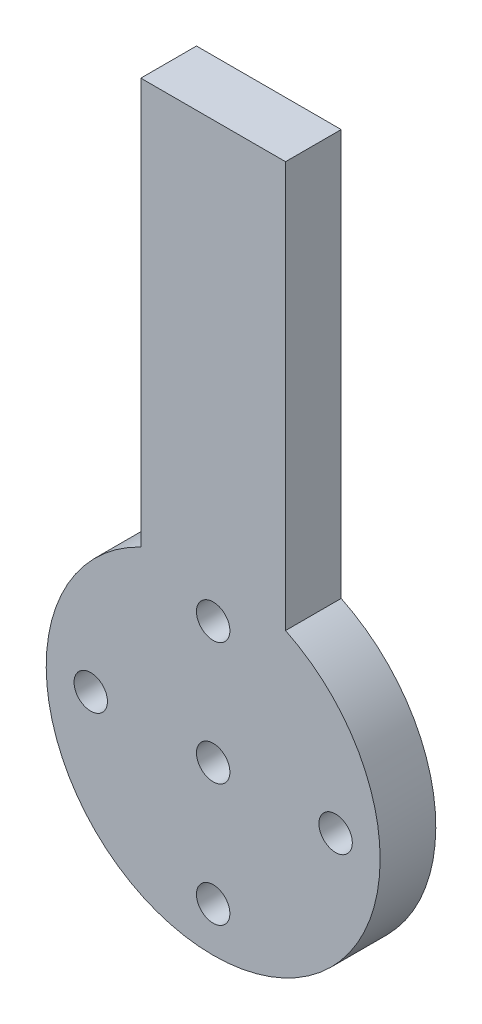
ISO-10303-21;
HEADER;
FILE_DESCRIPTION(('STEP AP214'),'2;1');
FILE_NAME('part.step','',(''),(''),'','','');
FILE_SCHEMA(('AUTOMOTIVE_DESIGN { 1 0 10303 214 1 1 1 1 }'));
ENDSEC;
DATA;
#1=APPLICATION_CONTEXT('core data for automotive mechanical design processes');
#2=APPLICATION_PROTOCOL_DEFINITION('international standard','automotive_design',2000,#1);
#3=PRODUCT_CONTEXT('',#1,'mechanical');
#4=PRODUCT('Part','Part','',(#3));
#5=PRODUCT_RELATED_PRODUCT_CATEGORY('part','',(#4));
#6=PRODUCT_DEFINITION_FORMATION('','',#4);
#7=PRODUCT_DEFINITION_CONTEXT('part definition',#1,'design');
#8=PRODUCT_DEFINITION('design','',#6,#7);
#9=PRODUCT_DEFINITION_SHAPE('','',#8);
#10=(LENGTH_UNIT() NAMED_UNIT(*) SI_UNIT(.MILLI.,.METRE.));
#11=(NAMED_UNIT(*) PLANE_ANGLE_UNIT() SI_UNIT($,.RADIAN.));
#12=(NAMED_UNIT(*) SI_UNIT($,.STERADIAN.) SOLID_ANGLE_UNIT());
#13=UNCERTAINTY_MEASURE_WITH_UNIT(LENGTH_MEASURE(1.E-05),#10,'distance_accuracy_value','');
#14=(GEOMETRIC_REPRESENTATION_CONTEXT(3) GLOBAL_UNCERTAINTY_ASSIGNED_CONTEXT((#13)) GLOBAL_UNIT_ASSIGNED_CONTEXT((#10,
#11,#12)) REPRESENTATION_CONTEXT('',''));
#15=CARTESIAN_POINT('',(0.,0.,0.));
#16=DIRECTION('',(0.,0.,1.));
#17=DIRECTION('',(1.,0.,0.));
#18=AXIS2_PLACEMENT_3D('',#15,#16,#17);
#19=CARTESIAN_POINT('',(2475.30786014581,4692.94783568175,5.));
#20=DIRECTION('',(0.,0.,1.));
#21=DIRECTION('',(1.,0.,0.));
#22=AXIS2_PLACEMENT_3D('',#19,#20,#21);
#23=PLANE('',#22);
#24=CARTESIAN_POINT('',(2475.30786014581,4703.94783568175,5.));
#25=DIRECTION('',(0.,0.,1.));
#26=DIRECTION('',(1.,0.,0.));
#27=AXIS2_PLACEMENT_3D('',#24,#25,#26);
#28=CIRCLE('',#27,1.50000000000006);
#29=CARTESIAN_POINT('',(2476.80786014581,4703.94783568175,5.));
#30=VERTEX_POINT('',#29);
#31=EDGE_CURVE('E129',#30,#30,#28,.T.);
#32=ORIENTED_EDGE('',*,*,#31,.F.);
#33=EDGE_LOOP('',(#32));
#34=FACE_BOUND('',#33,.T.);
#35=CARTESIAN_POINT('',(2464.30786014581,4692.94783568175,5.));
#36=DIRECTION('',(0.,0.,1.));
#37=DIRECTION('',(1.,0.,0.));
#38=AXIS2_PLACEMENT_3D('',#35,#36,#37);
#39=CIRCLE('',#38,1.50000000000006);
#40=CARTESIAN_POINT('',(2465.80786014581,4692.94783568175,5.));
#41=VERTEX_POINT('',#40);
#42=EDGE_CURVE('E117',#41,#41,#39,.T.);
#43=ORIENTED_EDGE('',*,*,#42,.F.);
#44=EDGE_LOOP('',(#43));
#45=FACE_BOUND('',#44,.T.);
#46=CARTESIAN_POINT('',(2475.30786014581,4692.94783568175,5.));
#47=DIRECTION('',(0.,0.,1.));
#48=DIRECTION('',(1.,0.,0.));
#49=AXIS2_PLACEMENT_3D('',#46,#47,#48);
#50=CIRCLE('',#49,14.9999999999997);
#51=CARTESIAN_POINT('',(2468.80786014581,4706.46634151635,5.));
#52=VERTEX_POINT('',#51);
#53=CARTESIAN_POINT('',(2481.80786014581,4706.46634151635,5.));
#54=VERTEX_POINT('',#53);
#55=EDGE_CURVE('E87',#52,#54,#50,.T.);
#56=ORIENTED_EDGE('',*,*,#55,.T.);
#57=DIRECTION('',(0.,1.,0.));
#58=VECTOR('',#57,1.);
#59=CARTESIAN_POINT('',(2481.80786014581,4742.94783568175,5.));
#60=LINE('',#59,#58);
#61=CARTESIAN_POINT('',(2481.80786014581,4742.94783568175,5.));
#62=VERTEX_POINT('',#61);
#63=EDGE_CURVE('E82',#54,#62,#60,.T.);
#64=ORIENTED_EDGE('',*,*,#63,.T.);
#65=DIRECTION('',(-1.,0.,0.));
#66=VECTOR('',#65,1.);
#67=CARTESIAN_POINT('',(2468.80786014581,4742.94783568175,5.));
#68=LINE('',#67,#66);
#69=CARTESIAN_POINT('',(2468.80786014581,4742.94783568175,5.));
#70=VERTEX_POINT('',#69);
#71=EDGE_CURVE('E85',#62,#70,#68,.T.);
#72=ORIENTED_EDGE('',*,*,#71,.T.);
#73=DIRECTION('',(0.,-1.,0.));
#74=VECTOR('',#73,1.);
#75=CARTESIAN_POINT('',(2468.80786014581,4706.46634151635,5.));
#76=LINE('',#75,#74);
#77=EDGE_CURVE('E52',#70,#52,#76,.T.);
#78=ORIENTED_EDGE('',*,*,#77,.T.);
#79=EDGE_LOOP('',(#56,#64,#72,#78));
#80=FACE_BOUND('',#79,.T.);
#81=CARTESIAN_POINT('',(2475.30786014581,4692.94783568175,5.));
#82=DIRECTION('',(0.,0.,1.));
#83=DIRECTION('',(1.,0.,0.));
#84=AXIS2_PLACEMENT_3D('',#81,#82,#83);
#85=CIRCLE('',#84,1.50000000000006);
#86=CARTESIAN_POINT('',(2476.80786014581,4692.94783568175,5.));
#87=VERTEX_POINT('',#86);
#88=EDGE_CURVE('E102',#87,#87,#85,.T.);
#89=ORIENTED_EDGE('',*,*,#88,.F.);
#90=EDGE_LOOP('',(#89));
#91=FACE_BOUND('',#90,.T.);
#92=CARTESIAN_POINT('',(2486.30786014581,4692.94783568175,5.));
#93=DIRECTION('',(0.,0.,1.));
#94=DIRECTION('',(1.,0.,0.));
#95=AXIS2_PLACEMENT_3D('',#92,#93,#94);
#96=CIRCLE('',#95,1.50000000000006);
#97=CARTESIAN_POINT('',(2487.80786014581,4692.94783568175,5.));
#98=VERTEX_POINT('',#97);
#99=EDGE_CURVE('E123',#98,#98,#96,.T.);
#100=ORIENTED_EDGE('',*,*,#99,.F.);
#101=EDGE_LOOP('',(#100));
#102=FACE_BOUND('',#101,.T.);
#103=CARTESIAN_POINT('',(2475.30786014581,4681.94783568175,5.));
#104=DIRECTION('',(0.,0.,1.));
#105=DIRECTION('',(1.,0.,0.));
#106=AXIS2_PLACEMENT_3D('',#103,#104,#105);
#107=CIRCLE('',#106,1.50000000000006);
#108=CARTESIAN_POINT('',(2476.80786014581,4681.94783568175,5.));
#109=VERTEX_POINT('',#108);
#110=EDGE_CURVE('E135',#109,#109,#107,.T.);
#111=ORIENTED_EDGE('',*,*,#110,.F.);
#112=EDGE_LOOP('',(#111));
#113=FACE_BOUND('',#112,.T.);
#114=ADVANCED_FACE('F35',(#34,#45,#80,#91,#102,#113),#23,.T.);
#115=CARTESIAN_POINT('',(2475.30786014581,4692.94783568175,0.));
#116=DIRECTION('',(0.,0.,1.));
#117=DIRECTION('',(1.,0.,0.));
#118=AXIS2_PLACEMENT_3D('',#115,#116,#117);
#119=PLANE('',#118);
#120=CARTESIAN_POINT('',(2475.30786014581,4692.94783568175,0.));
#121=DIRECTION('',(0.,0.,1.));
#122=DIRECTION('',(1.,0.,0.));
#123=AXIS2_PLACEMENT_3D('',#120,#121,#122);
#124=CIRCLE('',#123,14.9999999999997);
#125=CARTESIAN_POINT('',(2468.80786014581,4706.46634151635,0.));
#126=VERTEX_POINT('',#125);
#127=CARTESIAN_POINT('',(2481.80786014581,4706.46634151635,0.));
#128=VERTEX_POINT('',#127);
#129=EDGE_CURVE('E99',#126,#128,#124,.T.);
#130=ORIENTED_EDGE('',*,*,#129,.F.);
#131=DIRECTION('',(0.,-1.,0.));
#132=VECTOR('',#131,1.);
#133=CARTESIAN_POINT('',(2468.80786014581,4706.46634151635,0.));
#134=LINE('',#133,#132);
#135=CARTESIAN_POINT('',(2468.80786014581,4742.94783568175,0.));
#136=VERTEX_POINT('',#135);
#137=EDGE_CURVE('E75',#136,#126,#134,.T.);
#138=ORIENTED_EDGE('',*,*,#137,.F.);
#139=DIRECTION('',(-1.,0.,0.));
#140=VECTOR('',#139,1.);
#141=CARTESIAN_POINT('',(2468.80786014581,4742.94783568175,0.));
#142=LINE('',#141,#140);
#143=CARTESIAN_POINT('',(2481.80786014581,4742.94783568175,0.));
#144=VERTEX_POINT('',#143);
#145=EDGE_CURVE('E69',#144,#136,#142,.T.);
#146=ORIENTED_EDGE('',*,*,#145,.F.);
#147=DIRECTION('',(0.,1.,0.));
#148=VECTOR('',#147,1.);
#149=CARTESIAN_POINT('',(2481.80786014581,4742.94783568175,0.));
#150=LINE('',#149,#148);
#151=EDGE_CURVE('E91',#128,#144,#150,.T.);
#152=ORIENTED_EDGE('',*,*,#151,.F.);
#153=EDGE_LOOP('',(#130,#138,#146,#152));
#154=FACE_BOUND('',#153,.T.);
#155=CARTESIAN_POINT('',(2475.30786014581,4692.94783568175,0.));
#156=DIRECTION('',(0.,0.,1.));
#157=DIRECTION('',(1.,0.,0.));
#158=AXIS2_PLACEMENT_3D('',#155,#156,#157);
#159=CIRCLE('',#158,1.50000000000006);
#160=CARTESIAN_POINT('',(2476.80786014581,4692.94783568175,0.));
#161=VERTEX_POINT('',#160);
#162=EDGE_CURVE('E114',#161,#161,#159,.T.);
#163=ORIENTED_EDGE('',*,*,#162,.T.);
#164=EDGE_LOOP('',(#163));
#165=FACE_BOUND('',#164,.T.);
#166=CARTESIAN_POINT('',(2464.30786014581,4692.94783568175,0.));
#167=DIRECTION('',(0.,0.,1.));
#168=DIRECTION('',(1.,0.,0.));
#169=AXIS2_PLACEMENT_3D('',#166,#167,#168);
#170=CIRCLE('',#169,1.50000000000006);
#171=CARTESIAN_POINT('',(2465.80786014581,4692.94783568175,0.));
#172=VERTEX_POINT('',#171);
#173=EDGE_CURVE('E120',#172,#172,#170,.T.);
#174=ORIENTED_EDGE('',*,*,#173,.T.);
#175=EDGE_LOOP('',(#174));
#176=FACE_BOUND('',#175,.T.);
#177=CARTESIAN_POINT('',(2486.30786014581,4692.94783568175,0.));
#178=DIRECTION('',(0.,0.,1.));
#179=DIRECTION('',(1.,0.,0.));
#180=AXIS2_PLACEMENT_3D('',#177,#178,#179);
#181=CIRCLE('',#180,1.50000000000006);
#182=CARTESIAN_POINT('',(2487.80786014581,4692.94783568175,0.));
#183=VERTEX_POINT('',#182);
#184=EDGE_CURVE('E126',#183,#183,#181,.T.);
#185=ORIENTED_EDGE('',*,*,#184,.T.);
#186=EDGE_LOOP('',(#185));
#187=FACE_BOUND('',#186,.T.);
#188=CARTESIAN_POINT('',(2475.30786014581,4703.94783568175,0.));
#189=DIRECTION('',(0.,0.,1.));
#190=DIRECTION('',(1.,0.,0.));
#191=AXIS2_PLACEMENT_3D('',#188,#189,#190);
#192=CIRCLE('',#191,1.50000000000006);
#193=CARTESIAN_POINT('',(2476.80786014581,4703.94783568175,0.));
#194=VERTEX_POINT('',#193);
#195=EDGE_CURVE('E132',#194,#194,#192,.T.);
#196=ORIENTED_EDGE('',*,*,#195,.T.);
#197=EDGE_LOOP('',(#196));
#198=FACE_BOUND('',#197,.T.);
#199=CARTESIAN_POINT('',(2475.30786014581,4681.94783568175,0.));
#200=DIRECTION('',(0.,0.,1.));
#201=DIRECTION('',(1.,0.,0.));
#202=AXIS2_PLACEMENT_3D('',#199,#200,#201);
#203=CIRCLE('',#202,1.50000000000006);
#204=CARTESIAN_POINT('',(2476.80786014581,4681.94783568175,0.));
#205=VERTEX_POINT('',#204);
#206=EDGE_CURVE('E138',#205,#205,#203,.T.);
#207=ORIENTED_EDGE('',*,*,#206,.T.);
#208=EDGE_LOOP('',(#207));
#209=FACE_BOUND('',#208,.T.);
#210=ADVANCED_FACE('F110',(#154,#165,#176,#187,#198,#209),#119,.F.);
#211=CARTESIAN_POINT('',(2475.30786014581,4692.94783568175,5.));
#212=DIRECTION('',(0.,0.,-1.));
#213=DIRECTION('',(-1.,0.,0.));
#214=AXIS2_PLACEMENT_3D('',#211,#212,#213);
#215=CYLINDRICAL_SURFACE('',#214,14.9999999999997);
#216=ORIENTED_EDGE('',*,*,#129,.T.);
#217=DIRECTION('',(0.,0.,-1.));
#218=VECTOR('',#217,1.);
#219=CARTESIAN_POINT('',(2481.80786014581,4706.46634151635,5.));
#220=LINE('',#219,#218);
#221=EDGE_CURVE('E11',#54,#128,#220,.T.);
#222=ORIENTED_EDGE('',*,*,#221,.F.);
#223=ORIENTED_EDGE('',*,*,#55,.F.);
#224=DIRECTION('',(0.,0.,-1.));
#225=VECTOR('',#224,1.);
#226=CARTESIAN_POINT('',(2468.80786014581,4706.46634151635,5.));
#227=LINE('',#226,#225);
#228=EDGE_CURVE('E95',#52,#126,#227,.T.);
#229=ORIENTED_EDGE('',*,*,#228,.T.);
#230=EDGE_LOOP('',(#216,#222,#223,#229));
#231=FACE_BOUND('',#230,.T.);
#232=ADVANCED_FACE('F37',(#231),#215,.T.);
#233=CARTESIAN_POINT('',(2481.80786014581,4742.94783568175,5.));
#234=DIRECTION('',(-1.,0.,0.));
#235=DIRECTION('',(0.,-1.,0.));
#236=AXIS2_PLACEMENT_3D('',#233,#234,#235);
#237=PLANE('',#236);
#238=ORIENTED_EDGE('',*,*,#151,.T.);
#239=DIRECTION('',(0.,0.,-1.));
#240=VECTOR('',#239,1.);
#241=CARTESIAN_POINT('',(2481.80786014581,4742.94783568175,5.));
#242=LINE('',#241,#240);
#243=EDGE_CURVE('E44',#62,#144,#242,.T.);
#244=ORIENTED_EDGE('',*,*,#243,.F.);
#245=ORIENTED_EDGE('',*,*,#63,.F.);
#246=ORIENTED_EDGE('',*,*,#221,.T.);
#247=EDGE_LOOP('',(#238,#244,#245,#246));
#248=FACE_BOUND('',#247,.T.);
#249=ADVANCED_FACE('F90',(#248),#237,.F.);
#250=CARTESIAN_POINT('',(2468.80786014581,4742.94783568175,5.));
#251=DIRECTION('',(0.,-1.,0.));
#252=DIRECTION('',(0.,0.,-1.));
#253=AXIS2_PLACEMENT_3D('',#250,#251,#252);
#254=PLANE('',#253);
#255=ORIENTED_EDGE('',*,*,#145,.T.);
#256=DIRECTION('',(0.,0.,-1.));
#257=VECTOR('',#256,1.);
#258=CARTESIAN_POINT('',(2468.80786014581,4742.94783568175,5.));
#259=LINE('',#258,#257);
#260=EDGE_CURVE('E92',#70,#136,#259,.T.);
#261=ORIENTED_EDGE('',*,*,#260,.F.);
#262=ORIENTED_EDGE('',*,*,#71,.F.);
#263=ORIENTED_EDGE('',*,*,#243,.T.);
#264=EDGE_LOOP('',(#255,#261,#262,#263));
#265=FACE_BOUND('',#264,.T.);
#266=ADVANCED_FACE('F93',(#265),#254,.F.);
#267=CARTESIAN_POINT('',(2468.80786014581,4706.46634151635,5.));
#268=DIRECTION('',(1.,0.,0.));
#269=DIRECTION('',(0.,1.,0.));
#270=AXIS2_PLACEMENT_3D('',#267,#268,#269);
#271=PLANE('',#270);
#272=ORIENTED_EDGE('',*,*,#137,.T.);
#273=ORIENTED_EDGE('',*,*,#228,.F.);
#274=ORIENTED_EDGE('',*,*,#77,.F.);
#275=ORIENTED_EDGE('',*,*,#260,.T.);
#276=EDGE_LOOP('',(#272,#273,#274,#275));
#277=FACE_BOUND('',#276,.T.);
#278=ADVANCED_FACE('F107',(#277),#271,.F.);
#279=CARTESIAN_POINT('',(2475.30786014581,4692.94783568175,5.));
#280=DIRECTION('',(0.,0.,-1.));
#281=DIRECTION('',(-1.,0.,0.));
#282=AXIS2_PLACEMENT_3D('',#279,#280,#281);
#283=CYLINDRICAL_SURFACE('',#282,1.50000000000006);
#284=ORIENTED_EDGE('',*,*,#88,.T.);
#285=EDGE_LOOP('',(#284));
#286=FACE_BOUND('',#285,.T.);
#287=ORIENTED_EDGE('',*,*,#162,.F.);
#288=EDGE_LOOP('',(#287));
#289=FACE_BOUND('',#288,.T.);
#290=ADVANCED_FACE('F157',(#286,#289),#283,.F.);
#291=CARTESIAN_POINT('',(2464.30786014581,4692.94783568175,5.));
#292=DIRECTION('',(0.,0.,-1.));
#293=DIRECTION('',(-1.,0.,0.));
#294=AXIS2_PLACEMENT_3D('',#291,#292,#293);
#295=CYLINDRICAL_SURFACE('',#294,1.50000000000006);
#296=ORIENTED_EDGE('',*,*,#42,.T.);
#297=EDGE_LOOP('',(#296));
#298=FACE_BOUND('',#297,.T.);
#299=ORIENTED_EDGE('',*,*,#173,.F.);
#300=EDGE_LOOP('',(#299));
#301=FACE_BOUND('',#300,.T.);
#302=ADVANCED_FACE('F203',(#298,#301),#295,.F.);
#303=CARTESIAN_POINT('',(2486.30786014581,4692.94783568175,5.));
#304=DIRECTION('',(0.,0.,-1.));
#305=DIRECTION('',(-1.,0.,0.));
#306=AXIS2_PLACEMENT_3D('',#303,#304,#305);
#307=CYLINDRICAL_SURFACE('',#306,1.50000000000006);
#308=ORIENTED_EDGE('',*,*,#99,.T.);
#309=EDGE_LOOP('',(#308));
#310=FACE_BOUND('',#309,.T.);
#311=ORIENTED_EDGE('',*,*,#184,.F.);
#312=EDGE_LOOP('',(#311));
#313=FACE_BOUND('',#312,.T.);
#314=ADVANCED_FACE('F211',(#310,#313),#307,.F.);
#315=CARTESIAN_POINT('',(2475.30786014581,4703.94783568175,5.));
#316=DIRECTION('',(0.,0.,-1.));
#317=DIRECTION('',(-1.,0.,0.));
#318=AXIS2_PLACEMENT_3D('',#315,#316,#317);
#319=CYLINDRICAL_SURFACE('',#318,1.50000000000006);
#320=ORIENTED_EDGE('',*,*,#31,.T.);
#321=EDGE_LOOP('',(#320));
#322=FACE_BOUND('',#321,.T.);
#323=ORIENTED_EDGE('',*,*,#195,.F.);
#324=EDGE_LOOP('',(#323));
#325=FACE_BOUND('',#324,.T.);
#326=ADVANCED_FACE('F219',(#322,#325),#319,.F.);
#327=CARTESIAN_POINT('',(2475.30786014581,4681.94783568175,5.));
#328=DIRECTION('',(0.,0.,-1.));
#329=DIRECTION('',(-1.,0.,0.));
#330=AXIS2_PLACEMENT_3D('',#327,#328,#329);
#331=CYLINDRICAL_SURFACE('',#330,1.50000000000006);
#332=ORIENTED_EDGE('',*,*,#110,.T.);
#333=EDGE_LOOP('',(#332));
#334=FACE_BOUND('',#333,.T.);
#335=ORIENTED_EDGE('',*,*,#206,.F.);
#336=EDGE_LOOP('',(#335));
#337=FACE_BOUND('',#336,.T.);
#338=ADVANCED_FACE('F144',(#334,#337),#331,.F.);
#339=CLOSED_SHELL('',(#114,#210,#232,#249,#266,#278,#290,#302,#314,#326,#338));
#340=MANIFOLD_SOLID_BREP('B2',#339);
#341=ADVANCED_BREP_SHAPE_REPRESENTATION('',(#18,#340),#14);
#342=SHAPE_DEFINITION_REPRESENTATION(#9,#341);
ENDSEC;
END-ISO-10303-21;
